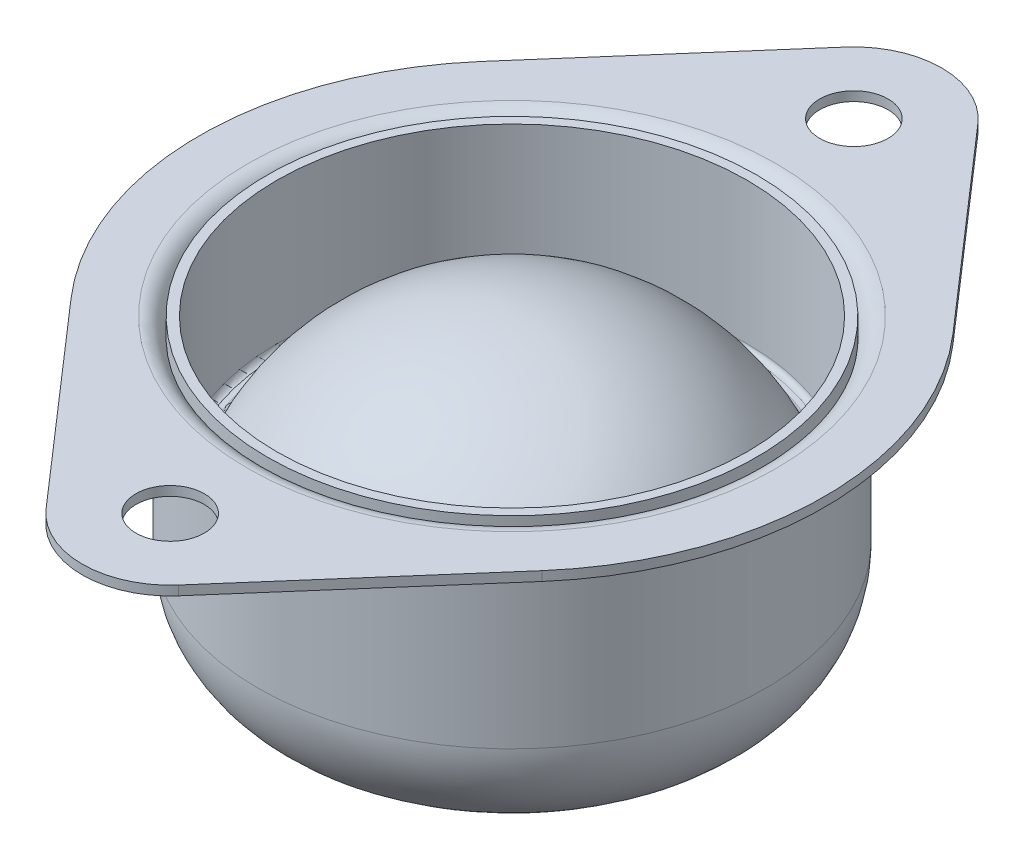
ISO-10303-21;
HEADER;
FILE_DESCRIPTION(('STEP AP214'),'2;1');
FILE_NAME('part.step','',(''),(''),'','','');
FILE_SCHEMA(('AUTOMOTIVE_DESIGN { 1 0 10303 214 1 1 1 1 }'));
ENDSEC;
DATA;
#1=APPLICATION_CONTEXT('core data for automotive mechanical design processes');
#2=APPLICATION_PROTOCOL_DEFINITION('international standard','automotive_design',2000,#1);
#3=PRODUCT_CONTEXT('',#1,'mechanical');
#4=PRODUCT('Part','Part','',(#3));
#5=PRODUCT_RELATED_PRODUCT_CATEGORY('part','',(#4));
#6=PRODUCT_DEFINITION_FORMATION('','',#4);
#7=PRODUCT_DEFINITION_CONTEXT('part definition',#1,'design');
#8=PRODUCT_DEFINITION('design','',#6,#7);
#9=PRODUCT_DEFINITION_SHAPE('','',#8);
#10=(LENGTH_UNIT() NAMED_UNIT(*) SI_UNIT(.MILLI.,.METRE.));
#11=(NAMED_UNIT(*) PLANE_ANGLE_UNIT() SI_UNIT($,.RADIAN.));
#12=(NAMED_UNIT(*) SI_UNIT($,.STERADIAN.) SOLID_ANGLE_UNIT());
#13=UNCERTAINTY_MEASURE_WITH_UNIT(LENGTH_MEASURE(1.E-05),#10,'distance_accuracy_value','');
#14=(GEOMETRIC_REPRESENTATION_CONTEXT(3) GLOBAL_UNCERTAINTY_ASSIGNED_CONTEXT((#13)) GLOBAL_UNIT_ASSIGNED_CONTEXT((#10,
#11,#12)) REPRESENTATION_CONTEXT('',''));
#15=CARTESIAN_POINT('',(0.,0.,0.));
#16=DIRECTION('',(0.,0.,1.));
#17=DIRECTION('',(1.,0.,0.));
#18=AXIS2_PLACEMENT_3D('',#15,#16,#17);
#19=CARTESIAN_POINT('',(0.,-16.7005,0.));
#20=DIRECTION('',(0.,-1.,0.));
#21=DIRECTION('',(0.,0.,1.));
#22=AXIS2_PLACEMENT_3D('',#19,#20,#21);
#23=SPHERICAL_SURFACE('',#22,12.7);
#24=CARTESIAN_POINT('',(0.,-29.4005,0.));
#25=VERTEX_POINT('',#24);
#26=VERTEX_LOOP('',#25);
#27=FACE_BOUND('',#26,.T.);
#28=ADVANCED_FACE('F40',(#27),#23,.T.);
#29=CLOSED_SHELL('',(#28));
#30=MANIFOLD_SOLID_BREP('B2',#29);
#31=CARTESIAN_POINT('',(0.,-11.938,0.));
#32=DIRECTION('',(0.,1.,0.));
#33=DIRECTION('',(0.,0.,1.));
#34=AXIS2_PLACEMENT_3D('',#31,#32,#33);
#35=CYLINDRICAL_SURFACE('',#34,19.8755);
#36=CARTESIAN_POINT('',(0.,-10.747375,0.));
#37=DIRECTION('',(0.,1.,0.));
#38=DIRECTION('',(0.,0.,1.));
#39=AXIS2_PLACEMENT_3D('',#36,#37,#38);
#40=CIRCLE('',#39,19.8755);
#41=CARTESIAN_POINT('',(0.,-10.747375,19.8755));
#42=VERTEX_POINT('',#41);
#43=EDGE_CURVE('E78',#42,#42,#40,.T.);
#44=ORIENTED_EDGE('',*,*,#43,.T.);
#45=EDGE_LOOP('',(#44));
#46=FACE_BOUND('',#45,.T.);
#47=CARTESIAN_POINT('',(0.,0.762,0.));
#48=DIRECTION('',(0.,1.,0.));
#49=DIRECTION('',(0.,0.,1.));
#50=AXIS2_PLACEMENT_3D('',#47,#48,#49);
#51=CIRCLE('',#50,19.8755);
#52=CARTESIAN_POINT('',(0.,0.762,19.8755));
#53=VERTEX_POINT('',#52);
#54=EDGE_CURVE('E83',#53,#53,#51,.T.);
#55=ORIENTED_EDGE('',*,*,#54,.F.);
#56=EDGE_LOOP('',(#55));
#57=FACE_BOUND('',#56,.T.);
#58=ADVANCED_FACE('F63',(#46,#57),#35,.T.);
#59=CARTESIAN_POINT('',(0.,-11.938,0.));
#60=DIRECTION('',(0.,1.,0.));
#61=DIRECTION('',(0.,0.,1.));
#62=AXIS2_PLACEMENT_3D('',#59,#60,#61);
#63=PLANE('',#62);
#64=CARTESIAN_POINT('',(0.,-11.938,0.));
#65=DIRECTION('',(0.,1.,0.));
#66=DIRECTION('',(0.,0.,1.));
#67=AXIS2_PLACEMENT_3D('',#64,#65,#66);
#68=CIRCLE('',#67,18.684875);
#69=CARTESIAN_POINT('',(0.,-11.938,18.684875));
#70=VERTEX_POINT('',#69);
#71=EDGE_CURVE('E70',#70,#70,#68,.F.);
#72=ORIENTED_EDGE('',*,*,#71,.T.);
#73=EDGE_LOOP('',(#72));
#74=FACE_BOUND('',#73,.T.);
#75=CARTESIAN_POINT('',(0.,-11.938,0.));
#76=DIRECTION('',(0.,1.,0.));
#77=DIRECTION('',(0.,0.,1.));
#78=AXIS2_PLACEMENT_3D('',#75,#76,#77);
#79=CIRCLE('',#78,18.2583205347589);
#80=CARTESIAN_POINT('',(0.,-11.938,18.2583205347589));
#81=VERTEX_POINT('',#80);
#82=EDGE_CURVE('E74',#81,#81,#79,.T.);
#83=ORIENTED_EDGE('',*,*,#82,.T.);
#84=EDGE_LOOP('',(#83));
#85=FACE_BOUND('',#84,.T.);
#86=ADVANCED_FACE('F115',(#74,#85),#63,.F.);
#87=CARTESIAN_POINT('',(0.,0.762,0.));
#88=DIRECTION('',(0.,1.,0.));
#89=DIRECTION('',(0.,0.,1.));
#90=AXIS2_PLACEMENT_3D('',#87,#88,#89);
#91=PLANE('',#90);
#92=CARTESIAN_POINT('',(0.,0.762000000000001,0.));
#93=DIRECTION('',(0.,1.,0.));
#94=DIRECTION('',(0.,0.,1.));
#95=AXIS2_PLACEMENT_3D('',#92,#93,#94);
#96=CIRCLE('',#95,19.1135);
#97=CARTESIAN_POINT('',(0.,0.762000000000001,19.1135));
#98=VERTEX_POINT('',#97);
#99=EDGE_CURVE('E87',#98,#98,#96,.T.);
#100=ORIENTED_EDGE('',*,*,#99,.F.);
#101=EDGE_LOOP('',(#100));
#102=FACE_BOUND('',#101,.T.);
#103=ORIENTED_EDGE('',*,*,#54,.T.);
#104=EDGE_LOOP('',(#103));
#105=FACE_BOUND('',#104,.T.);
#106=ADVANCED_FACE('F111',(#102,#105),#91,.T.);
#107=CARTESIAN_POINT('',(0.,-18.7407752659574,0.));
#108=DIRECTION('',(0.,-1.,0.));
#109=DIRECTION('',(0.,0.,1.));
#110=AXIS2_PLACEMENT_3D('',#107,#108,#109);
#111=SPHERICAL_SURFACE('',#110,18.7407752659574);
#112=CARTESIAN_POINT('',(0.,-11.2248699107771,0.));
#113=DIRECTION('',(0.,-1.,0.));
#114=DIRECTION('',(0.,0.,-1.));
#115=AXIS2_PLACEMENT_3D('',#112,#113,#114);
#116=CIRCLE('',#115,17.1676388668067);
#117=CARTESIAN_POINT('',(0.,-11.2248699107771,-17.1676388668067));
#118=VERTEX_POINT('',#117);
#119=EDGE_CURVE('E39',#118,#118,#116,.T.);
#120=ORIENTED_EDGE('',*,*,#119,.T.);
#121=EDGE_LOOP('',(#120));
#122=FACE_BOUND('',#121,.T.);
#123=ADVANCED_FACE('F114',(#122),#111,.F.);
#124=CARTESIAN_POINT('',(0.,-10.747375,0.));
#125=DIRECTION('',(0.,1.,0.));
#126=DIRECTION('',(0.,0.,1.));
#127=AXIS2_PLACEMENT_3D('',#124,#125,#126);
#128=TOROIDAL_SURFACE('',#127,18.684875,1.190625);
#129=ORIENTED_EDGE('',*,*,#71,.F.);
#130=EDGE_LOOP('',(#129));
#131=FACE_BOUND('',#130,.T.);
#132=ORIENTED_EDGE('',*,*,#43,.F.);
#133=EDGE_LOOP('',(#132));
#134=FACE_BOUND('',#133,.T.);
#135=ADVANCED_FACE('F126',(#131,#134),#128,.T.);
#136=CARTESIAN_POINT('',(0.,-10.747375,0.));
#137=DIRECTION('',(0.,1.,0.));
#138=DIRECTION('',(0.,0.,1.));
#139=AXIS2_PLACEMENT_3D('',#136,#137,#138);
#140=TOROIDAL_SURFACE('',#139,18.2583205347589,1.190625);
#141=ORIENTED_EDGE('',*,*,#82,.F.);
#142=EDGE_LOOP('',(#141));
#143=FACE_BOUND('',#142,.T.);
#144=ORIENTED_EDGE('',*,*,#119,.F.);
#145=EDGE_LOOP('',(#144));
#146=FACE_BOUND('',#145,.T.);
#147=ADVANCED_FACE('F65',(#143,#146),#140,.T.);
#148=CARTESIAN_POINT('',(0.,-11.938,0.));
#149=DIRECTION('',(0.,1.,0.));
#150=DIRECTION('',(0.,0.,1.));
#151=AXIS2_PLACEMENT_3D('',#148,#149,#150);
#152=CYLINDRICAL_SURFACE('',#151,19.1135);
#153=CARTESIAN_POINT('',(0.,-10.747375,0.));
#154=DIRECTION('',(0.,1.,0.));
#155=DIRECTION('',(0.,0.,1.));
#156=AXIS2_PLACEMENT_3D('',#153,#154,#155);
#157=CIRCLE('',#156,19.1135);
#158=CARTESIAN_POINT('',(0.,-10.747375,19.1135));
#159=VERTEX_POINT('',#158);
#160=EDGE_CURVE('E90',#159,#159,#157,.T.);
#161=ORIENTED_EDGE('',*,*,#160,.F.);
#162=EDGE_LOOP('',(#161));
#163=FACE_BOUND('',#162,.T.);
#164=ORIENTED_EDGE('',*,*,#99,.T.);
#165=EDGE_LOOP('',(#164));
#166=FACE_BOUND('',#165,.T.);
#167=ADVANCED_FACE('F104',(#163,#166),#152,.F.);
#168=CARTESIAN_POINT('',(0.,-11.176,0.));
#169=DIRECTION('',(0.,1.,0.));
#170=DIRECTION('',(0.,0.,1.));
#171=AXIS2_PLACEMENT_3D('',#168,#169,#170);
#172=PLANE('',#171);
#173=CARTESIAN_POINT('',(0.,-11.176,0.));
#174=DIRECTION('',(0.,1.,0.));
#175=DIRECTION('',(0.,0.,1.));
#176=AXIS2_PLACEMENT_3D('',#173,#174,#175);
#177=CIRCLE('',#176,18.684875);
#178=CARTESIAN_POINT('',(0.,-11.176,18.684875));
#179=VERTEX_POINT('',#178);
#180=EDGE_CURVE('E93',#179,#179,#177,.F.);
#181=ORIENTED_EDGE('',*,*,#180,.F.);
#182=EDGE_LOOP('',(#181));
#183=FACE_BOUND('',#182,.T.);
#184=CARTESIAN_POINT('',(0.,-11.176,0.));
#185=DIRECTION('',(0.,1.,0.));
#186=DIRECTION('',(0.,0.,1.));
#187=AXIS2_PLACEMENT_3D('',#184,#185,#186);
#188=CIRCLE('',#187,18.2583205347589);
#189=CARTESIAN_POINT('',(0.,-11.176,18.2583205347589));
#190=VERTEX_POINT('',#189);
#191=EDGE_CURVE('E94',#190,#190,#188,.T.);
#192=ORIENTED_EDGE('',*,*,#191,.F.);
#193=EDGE_LOOP('',(#192));
#194=FACE_BOUND('',#193,.T.);
#195=ADVANCED_FACE('F107',(#183,#194),#172,.T.);
#196=CARTESIAN_POINT('',(0.,-18.7407752659574,0.));
#197=DIRECTION('',(0.,-1.,0.));
#198=DIRECTION('',(0.,0.,1.));
#199=AXIS2_PLACEMENT_3D('',#196,#197,#198);
#200=SPHERICAL_SURFACE('',#199,19.5027752659574);
#201=CARTESIAN_POINT('',(0.,-10.9192731678797,0.));
#202=DIRECTION('',(0.,-1.,0.));
#203=DIRECTION('',(0.,0.,-1.));
#204=AXIS2_PLACEMENT_3D('',#201,#202,#203);
#205=CIRCLE('',#204,17.8656751342961);
#206=CARTESIAN_POINT('',(0.,-10.9192731678797,-17.8656751342961));
#207=VERTEX_POINT('',#206);
#208=EDGE_CURVE('E86',#207,#207,#205,.T.);
#209=ORIENTED_EDGE('',*,*,#208,.F.);
#210=EDGE_LOOP('',(#209));
#211=FACE_BOUND('',#210,.T.);
#212=ADVANCED_FACE('F146',(#211),#200,.T.);
#213=CARTESIAN_POINT('',(0.,-10.747375,0.));
#214=DIRECTION('',(0.,1.,0.));
#215=DIRECTION('',(0.,0.,1.));
#216=AXIS2_PLACEMENT_3D('',#213,#214,#215);
#217=TOROIDAL_SURFACE('',#216,18.684875,0.428625);
#218=ORIENTED_EDGE('',*,*,#180,.T.);
#219=EDGE_LOOP('',(#218));
#220=FACE_BOUND('',#219,.T.);
#221=ORIENTED_EDGE('',*,*,#160,.T.);
#222=EDGE_LOOP('',(#221));
#223=FACE_BOUND('',#222,.T.);
#224=ADVANCED_FACE('F102',(#220,#223),#217,.F.);
#225=CARTESIAN_POINT('',(0.,-10.747375,0.));
#226=DIRECTION('',(0.,1.,0.));
#227=DIRECTION('',(0.,0.,1.));
#228=AXIS2_PLACEMENT_3D('',#225,#226,#227);
#229=TOROIDAL_SURFACE('',#228,18.2583205347589,0.428625);
#230=ORIENTED_EDGE('',*,*,#191,.T.);
#231=EDGE_LOOP('',(#230));
#232=FACE_BOUND('',#231,.T.);
#233=ORIENTED_EDGE('',*,*,#208,.T.);
#234=EDGE_LOOP('',(#233));
#235=FACE_BOUND('',#234,.T.);
#236=ADVANCED_FACE('F140',(#232,#235),#229,.F.);
#237=CLOSED_SHELL('',(#58,#86,#106,#123,#135,#147,#167,#195,#212,#224,#236));
#238=MANIFOLD_SOLID_BREP('B6',#237);
#239=CARTESIAN_POINT('',(0.,0.762,0.));
#240=DIRECTION('',(0.,1.,0.));
#241=DIRECTION('',(0.,0.,1.));
#242=AXIS2_PLACEMENT_3D('',#239,#240,#241);
#243=PLANE('',#242);
#244=CARTESIAN_POINT('',(0.,0.762,0.));
#245=DIRECTION('',(0.,1.,0.));
#246=DIRECTION('',(0.,0.,1.));
#247=AXIS2_PLACEMENT_3D('',#244,#245,#246);
#248=CIRCLE('',#247,21.463);
#249=CARTESIAN_POINT('',(0.,0.762,21.463));
#250=VERTEX_POINT('',#249);
#251=EDGE_CURVE('E234',#250,#250,#248,.F.);
#252=ORIENTED_EDGE('',*,*,#251,.T.);
#253=EDGE_LOOP('',(#252));
#254=FACE_BOUND('',#253,.T.);
#255=CARTESIAN_POINT('',(0.,0.762,-27.78125));
#256=DIRECTION('',(0.,1.,0.));
#257=DIRECTION('',(0.,0.,1.));
#258=AXIS2_PLACEMENT_3D('',#255,#256,#257);
#259=CIRCLE('',#258,2.778125);
#260=CARTESIAN_POINT('',(0.,0.762,-30.559375));
#261=VERTEX_POINT('',#260);
#262=EDGE_CURVE('E327',#261,#261,#259,.T.);
#263=ORIENTED_EDGE('',*,*,#262,.F.);
#264=EDGE_LOOP('',(#263));
#265=FACE_BOUND('',#264,.T.);
#266=CARTESIAN_POINT('',(0.,0.762,0.));
#267=DIRECTION('',(0.,1.,0.));
#268=DIRECTION('',(0.,0.,1.));
#269=AXIS2_PLACEMENT_3D('',#266,#267,#268);
#270=CIRCLE('',#269,25.4);
#271=CARTESIAN_POINT('',(19.1456577908647,0.762,16.6914285714286));
#272=VERTEX_POINT('',#271);
#273=CARTESIAN_POINT('',(19.1456577908647,0.762,-16.6914285714286));
#274=VERTEX_POINT('',#273);
#275=EDGE_CURVE('E338',#272,#274,#270,.T.);
#276=ORIENTED_EDGE('',*,*,#275,.T.);
#277=DIRECTION('',(-0.657142857142857,0.,-0.753766054758452));
#278=VECTOR('',#277,1.);
#279=CARTESIAN_POINT('',(19.1456577908647,0.762,-16.6914285714286));
#280=LINE('',#279,#278);
#281=CARTESIAN_POINT('',(5.38471625368068,0.762,-32.4757142857143));
#282=VERTEX_POINT('',#281);
#283=EDGE_CURVE('E286',#274,#282,#280,.T.);
#284=ORIENTED_EDGE('',*,*,#283,.T.);
#285=CARTESIAN_POINT('',(0.,0.762,-27.78125));
#286=DIRECTION('',(0.,1.,0.));
#287=DIRECTION('',(0.,0.,1.));
#288=AXIS2_PLACEMENT_3D('',#285,#286,#287);
#289=CIRCLE('',#288,7.14374999999999);
#290=CARTESIAN_POINT('',(-5.38471625368071,0.762,-32.4757142857143));
#291=VERTEX_POINT('',#290);
#292=EDGE_CURVE('E458',#282,#291,#289,.T.);
#293=ORIENTED_EDGE('',*,*,#292,.T.);
#294=DIRECTION('',(-0.657142857142857,0.,0.753766054758452));
#295=VECTOR('',#294,1.);
#296=CARTESIAN_POINT('',(-5.38471625368071,0.762,-32.4757142857143));
#297=LINE('',#296,#295);
#298=CARTESIAN_POINT('',(-19.1456577908647,0.762,-16.6914285714286));
#299=VERTEX_POINT('',#298);
#300=EDGE_CURVE('E460',#291,#299,#297,.T.);
#301=ORIENTED_EDGE('',*,*,#300,.T.);
#302=CARTESIAN_POINT('',(0.,0.762,0.));
#303=DIRECTION('',(0.,1.,0.));
#304=DIRECTION('',(0.,0.,1.));
#305=AXIS2_PLACEMENT_3D('',#302,#303,#304);
#306=CIRCLE('',#305,25.4);
#307=CARTESIAN_POINT('',(-19.1456577908647,0.762,16.6914285714286));
#308=VERTEX_POINT('',#307);
#309=EDGE_CURVE('E305',#299,#308,#306,.T.);
#310=ORIENTED_EDGE('',*,*,#309,.T.);
#311=DIRECTION('',(0.657142857142857,0.,0.753766054758453));
#312=VECTOR('',#311,1.);
#313=CARTESIAN_POINT('',(-5.38471625368069,0.762,32.4757142857143));
#314=LINE('',#313,#312);
#315=CARTESIAN_POINT('',(-5.38471625368069,0.762,32.4757142857143));
#316=VERTEX_POINT('',#315);
#317=EDGE_CURVE('E299',#308,#316,#314,.T.);
#318=ORIENTED_EDGE('',*,*,#317,.T.);
#319=CARTESIAN_POINT('',(0.,0.762,27.78125));
#320=DIRECTION('',(0.,1.,0.));
#321=DIRECTION('',(0.,0.,1.));
#322=AXIS2_PLACEMENT_3D('',#319,#320,#321);
#323=CIRCLE('',#322,7.14375);
#324=CARTESIAN_POINT('',(5.38471625368069,0.762,32.4757142857143));
#325=VERTEX_POINT('',#324);
#326=EDGE_CURVE('E303',#316,#325,#323,.T.);
#327=ORIENTED_EDGE('',*,*,#326,.T.);
#328=DIRECTION('',(0.657142857142857,0.,-0.753766054758452));
#329=VECTOR('',#328,1.);
#330=CARTESIAN_POINT('',(19.1456577908647,0.762,16.6914285714286));
#331=LINE('',#330,#329);
#332=EDGE_CURVE('E242',#325,#272,#331,.T.);
#333=ORIENTED_EDGE('',*,*,#332,.T.);
#334=EDGE_LOOP('',(#276,#284,#293,#301,#310,#318,#327,#333));
#335=FACE_BOUND('',#334,.T.);
#336=CARTESIAN_POINT('',(0.,0.762,27.78125));
#337=DIRECTION('',(0.,1.,0.));
#338=DIRECTION('',(0.,0.,1.));
#339=AXIS2_PLACEMENT_3D('',#336,#337,#338);
#340=CIRCLE('',#339,2.778125);
#341=CARTESIAN_POINT('',(0.,0.762,25.003125));
#342=VERTEX_POINT('',#341);
#343=EDGE_CURVE('E446',#342,#342,#340,.T.);
#344=ORIENTED_EDGE('',*,*,#343,.F.);
#345=EDGE_LOOP('',(#344));
#346=FACE_BOUND('',#345,.T.);
#347=ADVANCED_FACE('F225',(#254,#265,#335,#346),#243,.T.);
#348=CARTESIAN_POINT('',(0.,0.,0.));
#349=DIRECTION('',(0.,1.,0.));
#350=DIRECTION('',(0.,0.,1.));
#351=AXIS2_PLACEMENT_3D('',#348,#349,#350);
#352=PLANE('',#351);
#353=CARTESIAN_POINT('',(0.,0.,0.));
#354=DIRECTION('',(0.,1.,0.));
#355=DIRECTION('',(0.,0.,1.));
#356=AXIS2_PLACEMENT_3D('',#353,#354,#355);
#357=CIRCLE('',#356,22.225);
#358=CARTESIAN_POINT('',(0.,0.,22.225));
#359=VERTEX_POINT('',#358);
#360=EDGE_CURVE('E359',#359,#359,#357,.T.);
#361=ORIENTED_EDGE('',*,*,#360,.T.);
#362=EDGE_LOOP('',(#361));
#363=FACE_BOUND('',#362,.T.);
#364=CARTESIAN_POINT('',(0.,0.,0.));
#365=DIRECTION('',(0.,1.,0.));
#366=DIRECTION('',(0.,0.,1.));
#367=AXIS2_PLACEMENT_3D('',#364,#365,#366);
#368=CIRCLE('',#367,25.4);
#369=CARTESIAN_POINT('',(19.1456577908647,0.,16.6914285714286));
#370=VERTEX_POINT('',#369);
#371=CARTESIAN_POINT('',(19.1456577908647,0.,-16.6914285714286));
#372=VERTEX_POINT('',#371);
#373=EDGE_CURVE('E323',#370,#372,#368,.T.);
#374=ORIENTED_EDGE('',*,*,#373,.F.);
#375=DIRECTION('',(0.657142857142857,0.,-0.753766054758452));
#376=VECTOR('',#375,1.);
#377=CARTESIAN_POINT('',(19.1456577908647,0.,16.6914285714286));
#378=LINE('',#377,#376);
#379=CARTESIAN_POINT('',(5.38471625368069,0.,32.4757142857143));
#380=VERTEX_POINT('',#379);
#381=EDGE_CURVE('E277',#380,#370,#378,.T.);
#382=ORIENTED_EDGE('',*,*,#381,.F.);
#383=CARTESIAN_POINT('',(0.,0.,27.78125));
#384=DIRECTION('',(0.,1.,0.));
#385=DIRECTION('',(0.,0.,1.));
#386=AXIS2_PLACEMENT_3D('',#383,#384,#385);
#387=CIRCLE('',#386,7.14375);
#388=CARTESIAN_POINT('',(-5.38471625368069,0.,32.4757142857143));
#389=VERTEX_POINT('',#388);
#390=EDGE_CURVE('E271',#389,#380,#387,.T.);
#391=ORIENTED_EDGE('',*,*,#390,.F.);
#392=DIRECTION('',(0.657142857142857,0.,0.753766054758453));
#393=VECTOR('',#392,1.);
#394=CARTESIAN_POINT('',(-5.38471625368069,0.,32.4757142857143));
#395=LINE('',#394,#393);
#396=CARTESIAN_POINT('',(-19.1456577908647,0.,16.6914285714286));
#397=VERTEX_POINT('',#396);
#398=EDGE_CURVE('E313',#397,#389,#395,.T.);
#399=ORIENTED_EDGE('',*,*,#398,.F.);
#400=CARTESIAN_POINT('',(0.,0.,0.));
#401=DIRECTION('',(0.,1.,0.));
#402=DIRECTION('',(0.,0.,1.));
#403=AXIS2_PLACEMENT_3D('',#400,#401,#402);
#404=CIRCLE('',#403,25.4);
#405=CARTESIAN_POINT('',(-19.1456577908647,0.,-16.6914285714286));
#406=VERTEX_POINT('',#405);
#407=EDGE_CURVE('E333',#406,#397,#404,.T.);
#408=ORIENTED_EDGE('',*,*,#407,.F.);
#409=DIRECTION('',(-0.657142857142857,0.,0.753766054758452));
#410=VECTOR('',#409,1.);
#411=CARTESIAN_POINT('',(-5.38471625368071,0.,-32.4757142857143));
#412=LINE('',#411,#410);
#413=CARTESIAN_POINT('',(-5.38471625368071,0.,-32.4757142857143));
#414=VERTEX_POINT('',#413);
#415=EDGE_CURVE('E331',#414,#406,#412,.T.);
#416=ORIENTED_EDGE('',*,*,#415,.F.);
#417=CARTESIAN_POINT('',(0.,0.,-27.78125));
#418=DIRECTION('',(0.,1.,0.));
#419=DIRECTION('',(0.,0.,1.));
#420=AXIS2_PLACEMENT_3D('',#417,#418,#419);
#421=CIRCLE('',#420,7.14374999999999);
#422=CARTESIAN_POINT('',(5.38471625368068,0.,-32.4757142857143));
#423=VERTEX_POINT('',#422);
#424=EDGE_CURVE('E329',#423,#414,#421,.T.);
#425=ORIENTED_EDGE('',*,*,#424,.F.);
#426=DIRECTION('',(-0.657142857142857,0.,-0.753766054758452));
#427=VECTOR('',#426,1.);
#428=CARTESIAN_POINT('',(19.1456577908647,0.,-16.6914285714286));
#429=LINE('',#428,#427);
#430=EDGE_CURVE('E326',#372,#423,#429,.T.);
#431=ORIENTED_EDGE('',*,*,#430,.F.);
#432=EDGE_LOOP('',(#374,#382,#391,#399,#408,#416,#425,#431));
#433=FACE_BOUND('',#432,.T.);
#434=CARTESIAN_POINT('',(0.,0.,-27.78125));
#435=DIRECTION('',(0.,1.,0.));
#436=DIRECTION('',(0.,0.,1.));
#437=AXIS2_PLACEMENT_3D('',#434,#435,#436);
#438=CIRCLE('',#437,2.778125);
#439=CARTESIAN_POINT('',(0.,0.,-30.559375));
#440=VERTEX_POINT('',#439);
#441=EDGE_CURVE('E449',#440,#440,#438,.T.);
#442=ORIENTED_EDGE('',*,*,#441,.T.);
#443=EDGE_LOOP('',(#442));
#444=FACE_BOUND('',#443,.T.);
#445=CARTESIAN_POINT('',(0.,0.,27.78125));
#446=DIRECTION('',(0.,1.,0.));
#447=DIRECTION('',(0.,0.,1.));
#448=AXIS2_PLACEMENT_3D('',#445,#446,#447);
#449=CIRCLE('',#448,2.778125);
#450=CARTESIAN_POINT('',(0.,0.,25.003125));
#451=VERTEX_POINT('',#450);
#452=EDGE_CURVE('E445',#451,#451,#449,.T.);
#453=ORIENTED_EDGE('',*,*,#452,.T.);
#454=EDGE_LOOP('',(#453));
#455=FACE_BOUND('',#454,.T.);
#456=ADVANCED_FACE('F380',(#363,#433,#444,#455),#352,.F.);
#457=CARTESIAN_POINT('',(0.,0.762,0.));
#458=DIRECTION('',(0.,-1.,0.));
#459=DIRECTION('',(0.,0.,-1.));
#460=AXIS2_PLACEMENT_3D('',#457,#458,#459);
#461=CYLINDRICAL_SURFACE('',#460,25.4);
#462=ORIENTED_EDGE('',*,*,#373,.T.);
#463=DIRECTION('',(0.,-1.,0.));
#464=VECTOR('',#463,1.);
#465=CARTESIAN_POINT('',(19.1456577908647,0.762,-16.6914285714286));
#466=LINE('',#465,#464);
#467=EDGE_CURVE('E351',#274,#372,#466,.T.);
#468=ORIENTED_EDGE('',*,*,#467,.F.);
#469=ORIENTED_EDGE('',*,*,#275,.F.);
#470=DIRECTION('',(0.,-1.,0.));
#471=VECTOR('',#470,1.);
#472=CARTESIAN_POINT('',(19.1456577908647,0.762,16.6914285714286));
#473=LINE('',#472,#471);
#474=EDGE_CURVE('E319',#272,#370,#473,.T.);
#475=ORIENTED_EDGE('',*,*,#474,.T.);
#476=EDGE_LOOP('',(#462,#468,#469,#475));
#477=FACE_BOUND('',#476,.T.);
#478=ADVANCED_FACE('F385',(#477),#461,.T.);
#479=CARTESIAN_POINT('',(19.1456577908647,0.762,-16.6914285714286));
#480=DIRECTION('',(-0.753766054758452,0.,0.657142857142857));
#481=DIRECTION('',(0.657142857142857,0.,0.753766054758452));
#482=AXIS2_PLACEMENT_3D('',#479,#480,#481);
#483=PLANE('',#482);
#484=ORIENTED_EDGE('',*,*,#430,.T.);
#485=DIRECTION('',(0.,-1.,0.));
#486=VECTOR('',#485,1.);
#487=CARTESIAN_POINT('',(5.38471625368068,0.762,-32.4757142857143));
#488=LINE('',#487,#486);
#489=EDGE_CURVE('E348',#282,#423,#488,.T.);
#490=ORIENTED_EDGE('',*,*,#489,.F.);
#491=ORIENTED_EDGE('',*,*,#283,.F.);
#492=ORIENTED_EDGE('',*,*,#467,.T.);
#493=EDGE_LOOP('',(#484,#490,#491,#492));
#494=FACE_BOUND('',#493,.T.);
#495=ADVANCED_FACE('F410',(#494),#483,.F.);
#496=CARTESIAN_POINT('',(0.,0.762,-27.78125));
#497=DIRECTION('',(0.,-1.,0.));
#498=DIRECTION('',(0.,0.,-1.));
#499=AXIS2_PLACEMENT_3D('',#496,#497,#498);
#500=CYLINDRICAL_SURFACE('',#499,7.14374999999999);
#501=ORIENTED_EDGE('',*,*,#424,.T.);
#502=DIRECTION('',(0.,-1.,0.));
#503=VECTOR('',#502,1.);
#504=CARTESIAN_POINT('',(-5.38471625368071,0.762,-32.4757142857143));
#505=LINE('',#504,#503);
#506=EDGE_CURVE('E345',#291,#414,#505,.T.);
#507=ORIENTED_EDGE('',*,*,#506,.F.);
#508=ORIENTED_EDGE('',*,*,#292,.F.);
#509=ORIENTED_EDGE('',*,*,#489,.T.);
#510=EDGE_LOOP('',(#501,#507,#508,#509));
#511=FACE_BOUND('',#510,.T.);
#512=ADVANCED_FACE('F406',(#511),#500,.T.);
#513=CARTESIAN_POINT('',(-5.38471625368071,0.762,-32.4757142857143));
#514=DIRECTION('',(0.753766054758452,0.,0.657142857142857));
#515=DIRECTION('',(0.657142857142857,0.,-0.753766054758452));
#516=AXIS2_PLACEMENT_3D('',#513,#514,#515);
#517=PLANE('',#516);
#518=ORIENTED_EDGE('',*,*,#415,.T.);
#519=DIRECTION('',(0.,-1.,0.));
#520=VECTOR('',#519,1.);
#521=CARTESIAN_POINT('',(-19.1456577908647,0.762,-16.6914285714286));
#522=LINE('',#521,#520);
#523=EDGE_CURVE('E342',#299,#406,#522,.T.);
#524=ORIENTED_EDGE('',*,*,#523,.F.);
#525=ORIENTED_EDGE('',*,*,#300,.F.);
#526=ORIENTED_EDGE('',*,*,#506,.T.);
#527=EDGE_LOOP('',(#518,#524,#525,#526));
#528=FACE_BOUND('',#527,.T.);
#529=ADVANCED_FACE('F402',(#528),#517,.F.);
#530=CARTESIAN_POINT('',(0.,0.762,0.));
#531=DIRECTION('',(0.,-1.,0.));
#532=DIRECTION('',(0.,0.,-1.));
#533=AXIS2_PLACEMENT_3D('',#530,#531,#532);
#534=CYLINDRICAL_SURFACE('',#533,25.4);
#535=ORIENTED_EDGE('',*,*,#407,.T.);
#536=DIRECTION('',(0.,-1.,0.));
#537=VECTOR('',#536,1.);
#538=CARTESIAN_POINT('',(-19.1456577908647,0.762,16.6914285714286));
#539=LINE('',#538,#537);
#540=EDGE_CURVE('E314',#308,#397,#539,.T.);
#541=ORIENTED_EDGE('',*,*,#540,.F.);
#542=ORIENTED_EDGE('',*,*,#309,.F.);
#543=ORIENTED_EDGE('',*,*,#523,.T.);
#544=EDGE_LOOP('',(#535,#541,#542,#543));
#545=FACE_BOUND('',#544,.T.);
#546=ADVANCED_FACE('F399',(#545),#534,.T.);
#547=CARTESIAN_POINT('',(-5.38471625368069,0.762,32.4757142857143));
#548=DIRECTION('',(0.753766054758452,0.,-0.657142857142857));
#549=DIRECTION('',(-0.657142857142857,0.,-0.753766054758453));
#550=AXIS2_PLACEMENT_3D('',#547,#548,#549);
#551=PLANE('',#550);
#552=ORIENTED_EDGE('',*,*,#398,.T.);
#553=DIRECTION('',(0.,-1.,0.));
#554=VECTOR('',#553,1.);
#555=CARTESIAN_POINT('',(-5.38471625368069,0.762,32.4757142857143));
#556=LINE('',#555,#554);
#557=EDGE_CURVE('E310',#316,#389,#556,.T.);
#558=ORIENTED_EDGE('',*,*,#557,.F.);
#559=ORIENTED_EDGE('',*,*,#317,.F.);
#560=ORIENTED_EDGE('',*,*,#540,.T.);
#561=EDGE_LOOP('',(#552,#558,#559,#560));
#562=FACE_BOUND('',#561,.T.);
#563=ADVANCED_FACE('F311',(#562),#551,.F.);
#564=CARTESIAN_POINT('',(0.,0.762,27.78125));
#565=DIRECTION('',(0.,-1.,0.));
#566=DIRECTION('',(0.,0.,-1.));
#567=AXIS2_PLACEMENT_3D('',#564,#565,#566);
#568=CYLINDRICAL_SURFACE('',#567,7.14375);
#569=ORIENTED_EDGE('',*,*,#390,.T.);
#570=DIRECTION('',(0.,-1.,0.));
#571=VECTOR('',#570,1.);
#572=CARTESIAN_POINT('',(5.38471625368069,0.762,32.4757142857143));
#573=LINE('',#572,#571);
#574=EDGE_CURVE('E315',#325,#380,#573,.T.);
#575=ORIENTED_EDGE('',*,*,#574,.F.);
#576=ORIENTED_EDGE('',*,*,#326,.F.);
#577=ORIENTED_EDGE('',*,*,#557,.T.);
#578=EDGE_LOOP('',(#569,#575,#576,#577));
#579=FACE_BOUND('',#578,.T.);
#580=ADVANCED_FACE('F317',(#579),#568,.T.);
#581=CARTESIAN_POINT('',(19.1456577908647,0.762,16.6914285714286));
#582=DIRECTION('',(-0.753766054758452,0.,-0.657142857142857));
#583=DIRECTION('',(-0.657142857142857,0.,0.753766054758453));
#584=AXIS2_PLACEMENT_3D('',#581,#582,#583);
#585=PLANE('',#584);
#586=ORIENTED_EDGE('',*,*,#381,.T.);
#587=ORIENTED_EDGE('',*,*,#474,.F.);
#588=ORIENTED_EDGE('',*,*,#332,.F.);
#589=ORIENTED_EDGE('',*,*,#574,.T.);
#590=EDGE_LOOP('',(#586,#587,#588,#589));
#591=FACE_BOUND('',#590,.T.);
#592=ADVANCED_FACE('F392',(#591),#585,.F.);
#593=CARTESIAN_POINT('',(0.,0.762,-27.78125));
#594=DIRECTION('',(0.,-1.,0.));
#595=DIRECTION('',(0.,0.,-1.));
#596=AXIS2_PLACEMENT_3D('',#593,#594,#595);
#597=CYLINDRICAL_SURFACE('',#596,2.778125);
#598=CARTESIAN_POINT('',(0.,0.762,-30.559375));
#599=CARTESIAN_POINT('',(0.,0.7540625,-30.559375));
#600=CARTESIAN_POINT('',(0.,0.746125,-30.559375));
#601=CARTESIAN_POINT('',(0.,0.73025,-30.559375));
#602=CARTESIAN_POINT('',(0.,0.7223125,-30.559375));
#603=CARTESIAN_POINT('',(0.,0.7064375,-30.559375));
#604=CARTESIAN_POINT('',(0.,0.6985,-30.559375));
#605=CARTESIAN_POINT('',(0.,0.682625,-30.559375));
#606=CARTESIAN_POINT('',(0.,0.6746875,-30.559375));
#607=CARTESIAN_POINT('',(0.,0.6588125,-30.559375));
#608=CARTESIAN_POINT('',(0.,0.650875,-30.559375));
#609=CARTESIAN_POINT('',(0.,0.635,-30.559375));
#610=CARTESIAN_POINT('',(0.,0.6270625,-30.559375));
#611=CARTESIAN_POINT('',(0.,0.6111875,-30.559375));
#612=CARTESIAN_POINT('',(0.,0.60325,-30.559375));
#613=CARTESIAN_POINT('',(0.,0.587375,-30.559375));
#614=CARTESIAN_POINT('',(0.,0.5794375,-30.559375));
#615=CARTESIAN_POINT('',(0.,0.5635625,-30.559375));
#616=CARTESIAN_POINT('',(0.,0.555625,-30.559375));
#617=CARTESIAN_POINT('',(0.,0.53975,-30.559375));
#618=CARTESIAN_POINT('',(0.,0.5318125,-30.559375));
#619=CARTESIAN_POINT('',(0.,0.5159375,-30.559375));
#620=CARTESIAN_POINT('',(0.,0.508,-30.559375));
#621=CARTESIAN_POINT('',(0.,0.492125,-30.559375));
#622=CARTESIAN_POINT('',(0.,0.4841875,-30.559375));
#623=CARTESIAN_POINT('',(0.,0.4683125,-30.559375));
#624=CARTESIAN_POINT('',(0.,0.460375,-30.559375));
#625=CARTESIAN_POINT('',(0.,0.4445,-30.559375));
#626=CARTESIAN_POINT('',(0.,0.4365625,-30.559375));
#627=CARTESIAN_POINT('',(0.,0.4206875,-30.559375));
#628=CARTESIAN_POINT('',(0.,0.41275,-30.559375));
#629=CARTESIAN_POINT('',(0.,0.396875,-30.559375));
#630=CARTESIAN_POINT('',(0.,0.3889375,-30.559375));
#631=CARTESIAN_POINT('',(0.,0.3730625,-30.559375));
#632=CARTESIAN_POINT('',(0.,0.365125,-30.559375));
#633=CARTESIAN_POINT('',(0.,0.34925,-30.559375));
#634=CARTESIAN_POINT('',(0.,0.3413125,-30.559375));
#635=CARTESIAN_POINT('',(0.,0.3254375,-30.559375));
#636=CARTESIAN_POINT('',(0.,0.3175,-30.559375));
#637=CARTESIAN_POINT('',(0.,0.301625,-30.559375));
#638=CARTESIAN_POINT('',(0.,0.2936875,-30.559375));
#639=CARTESIAN_POINT('',(0.,0.2778125,-30.559375));
#640=CARTESIAN_POINT('',(0.,0.269875,-30.559375));
#641=CARTESIAN_POINT('',(0.,0.254,-30.559375));
#642=CARTESIAN_POINT('',(0.,0.2460625,-30.559375));
#643=CARTESIAN_POINT('',(0.,0.2301875,-30.559375));
#644=CARTESIAN_POINT('',(0.,0.22225,-30.559375));
#645=CARTESIAN_POINT('',(0.,0.206375,-30.559375));
#646=CARTESIAN_POINT('',(0.,0.1984375,-30.559375));
#647=CARTESIAN_POINT('',(0.,0.1825625,-30.559375));
#648=CARTESIAN_POINT('',(0.,0.174625,-30.559375));
#649=CARTESIAN_POINT('',(0.,0.15875,-30.559375));
#650=CARTESIAN_POINT('',(0.,0.1508125,-30.559375));
#651=CARTESIAN_POINT('',(0.,0.1349375,-30.559375));
#652=CARTESIAN_POINT('',(0.,0.127,-30.559375));
#653=CARTESIAN_POINT('',(0.,0.111125,-30.559375));
#654=CARTESIAN_POINT('',(0.,0.1031875,-30.559375));
#655=CARTESIAN_POINT('',(0.,0.0873125,-30.559375));
#656=CARTESIAN_POINT('',(0.,0.079375,-30.559375));
#657=CARTESIAN_POINT('',(0.,0.0635,-30.559375));
#658=CARTESIAN_POINT('',(0.,0.0555625,-30.559375));
#659=CARTESIAN_POINT('',(0.,0.0396875,-30.559375));
#660=CARTESIAN_POINT('',(0.,0.03175,-30.559375));
#661=CARTESIAN_POINT('',(0.,0.015875,-30.559375));
#662=CARTESIAN_POINT('',(0.,0.00793749999999999,-30.559375));
#663=CARTESIAN_POINT('',(0.,0.,-30.559375));
#664=B_SPLINE_CURVE_WITH_KNOTS('',3,(#598,#599,#600,#601,#602,#603,#604,#605,#606,#607,#608,
#609,#610,#611,#612,#613,#614,#615,#616,#617,#618,#619,#620,#621,#622,#623,#624,#625,#626,#627,
#628,#629,#630,#631,#632,#633,#634,#635,#636,#637,#638,#639,#640,#641,#642,#643,#644,#645,#646,
#647,#648,#649,#650,#651,#652,#653,#654,#655,#656,#657,#658,#659,#660,#661,#662,#663),
.UNSPECIFIED.,.F.,.F.,(4,2,2,2,2,2,2,2,2,2,2,2,2,2,2,2,2,2,2,2,2,2,2,2,2,2,2,2,2,2,2,2,4),(0.,
0.0238125,0.0476249999999999,0.0714374999999999,0.09525,0.1190625,0.142875,0.1666875,0.1905,
0.2143125,0.238125,0.2619375,0.28575,0.3095625,0.333375,0.3571875,0.381,0.4048125,0.428625,
0.4524375,0.47625,0.5000625,0.523875,0.5476875,0.5715,0.5953125,0.619125,0.6429375,0.66675,
0.6905625,0.714375,0.7381875,0.762),.UNSPECIFIED.);
#665=EDGE_CURVE('BSEAM389',#261,#440,#664,.T.);
#666=ORIENTED_EDGE('',*,*,#262,.T.);
#667=ORIENTED_EDGE('',*,*,#441,.F.);
#668=ORIENTED_EDGE('',*,*,#665,.T.);
#669=ORIENTED_EDGE('',*,*,#665,.F.);
#670=EDGE_LOOP('',(#666,#668,#667,#669));
#671=FACE_BOUND('',#670,.T.);
#672=ADVANCED_FACE('F389',(#671),#597,.F.);
#673=CARTESIAN_POINT('',(0.,0.762,27.78125));
#674=DIRECTION('',(0.,-1.,0.));
#675=DIRECTION('',(0.,0.,-1.));
#676=AXIS2_PLACEMENT_3D('',#673,#674,#675);
#677=CYLINDRICAL_SURFACE('',#676,2.778125);
#678=CARTESIAN_POINT('',(0.,0.762,25.003125));
#679=CARTESIAN_POINT('',(0.,0.7540625,25.003125));
#680=CARTESIAN_POINT('',(0.,0.746125,25.003125));
#681=CARTESIAN_POINT('',(0.,0.73025,25.003125));
#682=CARTESIAN_POINT('',(0.,0.7223125,25.003125));
#683=CARTESIAN_POINT('',(0.,0.7064375,25.003125));
#684=CARTESIAN_POINT('',(0.,0.6985,25.003125));
#685=CARTESIAN_POINT('',(0.,0.682625,25.003125));
#686=CARTESIAN_POINT('',(0.,0.6746875,25.003125));
#687=CARTESIAN_POINT('',(0.,0.6588125,25.003125));
#688=CARTESIAN_POINT('',(0.,0.650875,25.003125));
#689=CARTESIAN_POINT('',(0.,0.635,25.003125));
#690=CARTESIAN_POINT('',(0.,0.6270625,25.003125));
#691=CARTESIAN_POINT('',(0.,0.6111875,25.003125));
#692=CARTESIAN_POINT('',(0.,0.60325,25.003125));
#693=CARTESIAN_POINT('',(0.,0.587375,25.003125));
#694=CARTESIAN_POINT('',(0.,0.5794375,25.003125));
#695=CARTESIAN_POINT('',(0.,0.5635625,25.003125));
#696=CARTESIAN_POINT('',(0.,0.555625,25.003125));
#697=CARTESIAN_POINT('',(0.,0.53975,25.003125));
#698=CARTESIAN_POINT('',(0.,0.5318125,25.003125));
#699=CARTESIAN_POINT('',(0.,0.5159375,25.003125));
#700=CARTESIAN_POINT('',(0.,0.508,25.003125));
#701=CARTESIAN_POINT('',(0.,0.492125,25.003125));
#702=CARTESIAN_POINT('',(0.,0.4841875,25.003125));
#703=CARTESIAN_POINT('',(0.,0.4683125,25.003125));
#704=CARTESIAN_POINT('',(0.,0.460375,25.003125));
#705=CARTESIAN_POINT('',(0.,0.4445,25.003125));
#706=CARTESIAN_POINT('',(0.,0.4365625,25.003125));
#707=CARTESIAN_POINT('',(0.,0.4206875,25.003125));
#708=CARTESIAN_POINT('',(0.,0.41275,25.003125));
#709=CARTESIAN_POINT('',(0.,0.396875,25.003125));
#710=CARTESIAN_POINT('',(0.,0.3889375,25.003125));
#711=CARTESIAN_POINT('',(0.,0.3730625,25.003125));
#712=CARTESIAN_POINT('',(0.,0.365125,25.003125));
#713=CARTESIAN_POINT('',(0.,0.34925,25.003125));
#714=CARTESIAN_POINT('',(0.,0.3413125,25.003125));
#715=CARTESIAN_POINT('',(0.,0.3254375,25.003125));
#716=CARTESIAN_POINT('',(0.,0.3175,25.003125));
#717=CARTESIAN_POINT('',(0.,0.301625,25.003125));
#718=CARTESIAN_POINT('',(0.,0.2936875,25.003125));
#719=CARTESIAN_POINT('',(0.,0.2778125,25.003125));
#720=CARTESIAN_POINT('',(0.,0.269875,25.003125));
#721=CARTESIAN_POINT('',(0.,0.254,25.003125));
#722=CARTESIAN_POINT('',(0.,0.2460625,25.003125));
#723=CARTESIAN_POINT('',(0.,0.2301875,25.003125));
#724=CARTESIAN_POINT('',(0.,0.22225,25.003125));
#725=CARTESIAN_POINT('',(0.,0.206375,25.003125));
#726=CARTESIAN_POINT('',(0.,0.1984375,25.003125));
#727=CARTESIAN_POINT('',(0.,0.1825625,25.003125));
#728=CARTESIAN_POINT('',(0.,0.174625,25.003125));
#729=CARTESIAN_POINT('',(0.,0.15875,25.003125));
#730=CARTESIAN_POINT('',(0.,0.1508125,25.003125));
#731=CARTESIAN_POINT('',(0.,0.1349375,25.003125));
#732=CARTESIAN_POINT('',(0.,0.127,25.003125));
#733=CARTESIAN_POINT('',(0.,0.111125,25.003125));
#734=CARTESIAN_POINT('',(0.,0.1031875,25.003125));
#735=CARTESIAN_POINT('',(0.,0.0873125,25.003125));
#736=CARTESIAN_POINT('',(0.,0.079375,25.003125));
#737=CARTESIAN_POINT('',(0.,0.0635,25.003125));
#738=CARTESIAN_POINT('',(0.,0.0555625,25.003125));
#739=CARTESIAN_POINT('',(0.,0.0396875,25.003125));
#740=CARTESIAN_POINT('',(0.,0.03175,25.003125));
#741=CARTESIAN_POINT('',(0.,0.015875,25.003125));
#742=CARTESIAN_POINT('',(0.,0.00793749999999999,25.003125));
#743=CARTESIAN_POINT('',(0.,0.,25.003125));
#744=B_SPLINE_CURVE_WITH_KNOTS('',3,(#678,#679,#680,#681,#682,#683,#684,#685,#686,#687,#688,
#689,#690,#691,#692,#693,#694,#695,#696,#697,#698,#699,#700,#701,#702,#703,#704,#705,#706,#707,
#708,#709,#710,#711,#712,#713,#714,#715,#716,#717,#718,#719,#720,#721,#722,#723,#724,#725,#726,
#727,#728,#729,#730,#731,#732,#733,#734,#735,#736,#737,#738,#739,#740,#741,#742,#743),
.UNSPECIFIED.,.F.,.F.,(4,2,2,2,2,2,2,2,2,2,2,2,2,2,2,2,2,2,2,2,2,2,2,2,2,2,2,2,2,2,2,2,4),(0.,
0.0238125,0.0476249999999999,0.0714374999999999,0.09525,0.1190625,0.142875,0.1666875,0.1905,
0.2143125,0.238125,0.2619375,0.28575,0.3095625,0.333375,0.3571875,0.381,0.4048125,0.428625,
0.4524375,0.47625,0.5000625,0.523875,0.5476875,0.5715,0.5953125,0.619125,0.6429375,0.66675,
0.6905625,0.714375,0.7381875,0.762),.UNSPECIFIED.);
#745=EDGE_CURVE('BSEAM428',#342,#451,#744,.T.);
#746=ORIENTED_EDGE('',*,*,#343,.T.);
#747=ORIENTED_EDGE('',*,*,#452,.F.);
#748=ORIENTED_EDGE('',*,*,#745,.T.);
#749=ORIENTED_EDGE('',*,*,#745,.F.);
#750=EDGE_LOOP('',(#746,#748,#747,#749));
#751=FACE_BOUND('',#750,.T.);
#752=ADVANCED_FACE('F428',(#751),#677,.F.);
#753=CARTESIAN_POINT('',(0.,-106.822164786949,0.));
#754=DIRECTION('',(0.,1.,0.));
#755=DIRECTION('',(0.,0.,1.));
#756=AXIS2_PLACEMENT_3D('',#753,#754,#755);
#757=CYLINDRICAL_SURFACE('',#756,20.6375);
#758=CARTESIAN_POINT('',(0.,-1.58750000000001,0.));
#759=DIRECTION('',(0.,1.,0.));
#760=DIRECTION('',(0.,0.,1.));
#761=AXIS2_PLACEMENT_3D('',#758,#759,#760);
#762=CIRCLE('',#761,20.6375);
#763=CARTESIAN_POINT('',(0.,-1.58750000000001,20.6375));
#764=VERTEX_POINT('',#763);
#765=EDGE_CURVE('E356',#764,#764,#762,.F.);
#766=ORIENTED_EDGE('',*,*,#765,.T.);
#767=EDGE_LOOP('',(#766));
#768=FACE_BOUND('',#767,.T.);
#769=CARTESIAN_POINT('',(0.,-15.113,0.));
#770=DIRECTION('',(0.,1.,0.));
#771=DIRECTION('',(0.,0.,1.));
#772=AXIS2_PLACEMENT_3D('',#769,#770,#771);
#773=CIRCLE('',#772,20.6375);
#774=CARTESIAN_POINT('',(0.,-15.113,20.6375));
#775=VERTEX_POINT('',#774);
#776=EDGE_CURVE('E353',#775,#775,#773,.T.);
#777=ORIENTED_EDGE('',*,*,#776,.T.);
#778=EDGE_LOOP('',(#777));
#779=FACE_BOUND('',#778,.T.);
#780=ADVANCED_FACE('F420',(#768,#779),#757,.T.);
#781=CARTESIAN_POINT('',(0.,-15.113,0.));
#782=DIRECTION('',(0.,1.,0.));
#783=DIRECTION('',(0.,0.,1.));
#784=AXIS2_PLACEMENT_3D('',#781,#782,#783);
#785=TOROIDAL_SURFACE('',#784,11.90625,8.73125);
#786=CARTESIAN_POINT('',(0.,-23.84425,0.));
#787=DIRECTION('',(0.,-1.,0.));
#788=DIRECTION('',(0.,0.,-1.));
#789=AXIS2_PLACEMENT_3D('',#786,#787,#788);
#790=CIRCLE('',#789,11.90625);
#791=CARTESIAN_POINT('',(0.,-23.84425,-11.90625));
#792=VERTEX_POINT('',#791);
#793=EDGE_CURVE('E434',#792,#792,#790,.T.);
#794=ORIENTED_EDGE('',*,*,#793,.F.);
#795=EDGE_LOOP('',(#794));
#796=FACE_BOUND('',#795,.T.);
#797=ORIENTED_EDGE('',*,*,#776,.F.);
#798=EDGE_LOOP('',(#797));
#799=FACE_BOUND('',#798,.T.);
#800=ADVANCED_FACE('F417',(#796,#799),#785,.T.);
#801=CARTESIAN_POINT('',(0.,-106.822164786949,0.));
#802=DIRECTION('',(0.,1.,0.));
#803=DIRECTION('',(0.,0.,1.));
#804=AXIS2_PLACEMENT_3D('',#801,#802,#803);
#805=CYLINDRICAL_SURFACE('',#804,19.8755);
#806=CARTESIAN_POINT('',(0.,-0.825500000000007,0.));
#807=DIRECTION('',(0.,1.,0.));
#808=DIRECTION('',(0.,0.,1.));
#809=AXIS2_PLACEMENT_3D('',#806,#807,#808);
#810=CIRCLE('',#809,19.8755);
#811=CARTESIAN_POINT('',(0.,-0.825500000000007,19.8755));
#812=VERTEX_POINT('',#811);
#813=EDGE_CURVE('E61',#812,#812,#810,.T.);
#814=ORIENTED_EDGE('',*,*,#813,.T.);
#815=EDGE_LOOP('',(#814));
#816=FACE_BOUND('',#815,.T.);
#817=CARTESIAN_POINT('',(0.,-15.113,0.));
#818=DIRECTION('',(0.,1.,0.));
#819=DIRECTION('',(0.,0.,1.));
#820=AXIS2_PLACEMENT_3D('',#817,#818,#819);
#821=CIRCLE('',#820,19.8755);
#822=CARTESIAN_POINT('',(0.,-15.113,19.8755));
#823=VERTEX_POINT('',#822);
#824=EDGE_CURVE('E440',#823,#823,#821,.T.);
#825=ORIENTED_EDGE('',*,*,#824,.F.);
#826=EDGE_LOOP('',(#825));
#827=FACE_BOUND('',#826,.T.);
#828=ADVANCED_FACE('F419',(#816,#827),#805,.F.);
#829=CARTESIAN_POINT('',(0.,-15.113,0.));
#830=DIRECTION('',(0.,1.,0.));
#831=DIRECTION('',(0.,0.,1.));
#832=AXIS2_PLACEMENT_3D('',#829,#830,#831);
#833=TOROIDAL_SURFACE('',#832,11.90625,7.96925);
#834=CARTESIAN_POINT('',(0.,-23.08225,0.));
#835=DIRECTION('',(0.,1.,0.));
#836=DIRECTION('',(0.,0.,1.));
#837=AXIS2_PLACEMENT_3D('',#834,#835,#836);
#838=CIRCLE('',#837,11.90625);
#839=CARTESIAN_POINT('',(0.,-23.08225,11.90625));
#840=VERTEX_POINT('',#839);
#841=EDGE_CURVE('E437',#840,#840,#838,.F.);
#842=ORIENTED_EDGE('',*,*,#841,.T.);
#843=EDGE_LOOP('',(#842));
#844=FACE_BOUND('',#843,.T.);
#845=ORIENTED_EDGE('',*,*,#824,.T.);
#846=EDGE_LOOP('',(#845));
#847=FACE_BOUND('',#846,.T.);
#848=ADVANCED_FACE('F376',(#844,#847),#833,.F.);
#849=CARTESIAN_POINT('',(0.,-1.58750000000001,0.));
#850=DIRECTION('',(0.,1.,0.));
#851=DIRECTION('',(0.,0.,1.));
#852=AXIS2_PLACEMENT_3D('',#849,#850,#851);
#853=TOROIDAL_SURFACE('',#852,22.225,1.5875);
#854=ORIENTED_EDGE('',*,*,#360,.F.);
#855=EDGE_LOOP('',(#854));
#856=FACE_BOUND('',#855,.T.);
#857=ORIENTED_EDGE('',*,*,#765,.F.);
#858=EDGE_LOOP('',(#857));
#859=FACE_BOUND('',#858,.T.);
#860=ADVANCED_FACE('F368',(#856,#859),#853,.F.);
#861=CARTESIAN_POINT('',(0.,-0.825500000000007,0.));
#862=DIRECTION('',(0.,1.,0.));
#863=DIRECTION('',(0.,0.,1.));
#864=AXIS2_PLACEMENT_3D('',#861,#862,#863);
#865=TOROIDAL_SURFACE('',#864,21.463,1.5875);
#866=ORIENTED_EDGE('',*,*,#813,.F.);
#867=EDGE_LOOP('',(#866));
#868=FACE_BOUND('',#867,.T.);
#869=ORIENTED_EDGE('',*,*,#251,.F.);
#870=EDGE_LOOP('',(#869));
#871=FACE_BOUND('',#870,.T.);
#872=ADVANCED_FACE('F227',(#868,#871),#865,.T.);
#873=CARTESIAN_POINT('',(0.,10.5937104540093,0.));
#874=DIRECTION('',(0.,-1.,0.));
#875=DIRECTION('',(0.,0.,-1.));
#876=AXIS2_PLACEMENT_3D('',#873,#874,#875);
#877=CYLINDRICAL_SURFACE('',#876,11.90625);
#878=ORIENTED_EDGE('',*,*,#793,.T.);
#879=EDGE_LOOP('',(#878));
#880=FACE_BOUND('',#879,.T.);
#881=ORIENTED_EDGE('',*,*,#841,.F.);
#882=EDGE_LOOP('',(#881));
#883=FACE_BOUND('',#882,.T.);
#884=ADVANCED_FACE('F367',(#880,#883),#877,.F.);
#885=CLOSED_SHELL('',(#347,#456,#478,#495,#512,#529,#546,#563,#580,#592,#672,#752,#780,#800,
#828,#848,#860,#872,#884));
#886=MANIFOLD_SOLID_BREP('B34',#885);
#887=ADVANCED_BREP_SHAPE_REPRESENTATION('',(#18,#30,#238,#886),#14);
#888=SHAPE_DEFINITION_REPRESENTATION(#9,#887);
ENDSEC;
END-ISO-10303-21;
